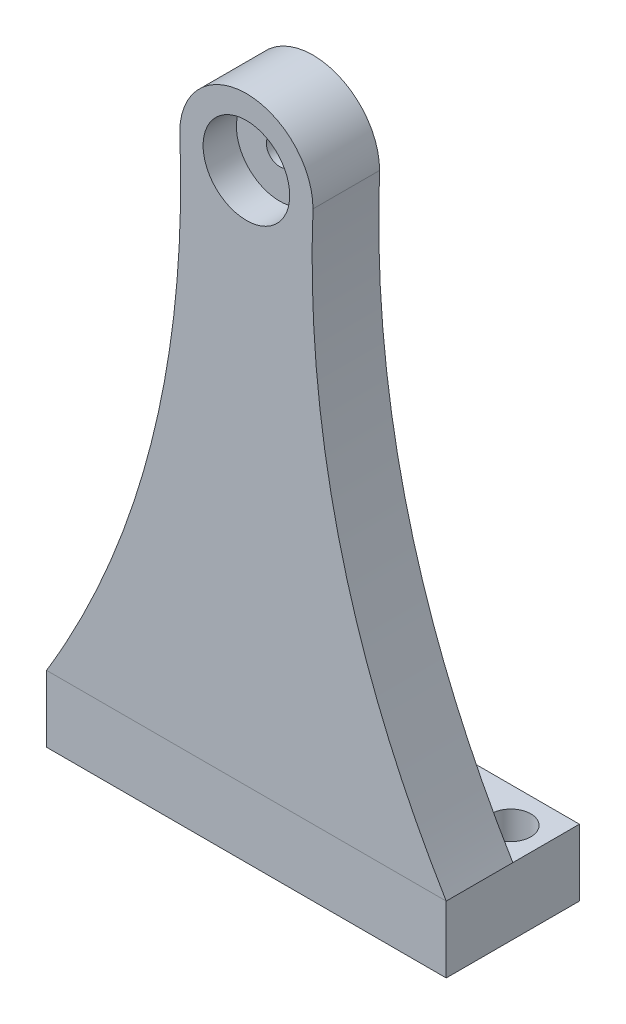
ISO-10303-21;
HEADER;
FILE_DESCRIPTION(('STEP AP214'),'2;1');
FILE_NAME('part.step','',(''),(''),'','','');
FILE_SCHEMA(('AUTOMOTIVE_DESIGN { 1 0 10303 214 1 1 1 1 }'));
ENDSEC;
DATA;
#1=APPLICATION_CONTEXT('core data for automotive mechanical design processes');
#2=APPLICATION_PROTOCOL_DEFINITION('international standard','automotive_design',2000,#1);
#3=PRODUCT_CONTEXT('',#1,'mechanical');
#4=PRODUCT('Part','Part','',(#3));
#5=PRODUCT_RELATED_PRODUCT_CATEGORY('part','',(#4));
#6=PRODUCT_DEFINITION_FORMATION('','',#4);
#7=PRODUCT_DEFINITION_CONTEXT('part definition',#1,'design');
#8=PRODUCT_DEFINITION('design','',#6,#7);
#9=PRODUCT_DEFINITION_SHAPE('','',#8);
#10=(LENGTH_UNIT() NAMED_UNIT(*) SI_UNIT(.MILLI.,.METRE.));
#11=(NAMED_UNIT(*) PLANE_ANGLE_UNIT() SI_UNIT($,.RADIAN.));
#12=(NAMED_UNIT(*) SI_UNIT($,.STERADIAN.) SOLID_ANGLE_UNIT());
#13=UNCERTAINTY_MEASURE_WITH_UNIT(LENGTH_MEASURE(1.E-05),#10,'distance_accuracy_value','');
#14=(GEOMETRIC_REPRESENTATION_CONTEXT(3) GLOBAL_UNCERTAINTY_ASSIGNED_CONTEXT((#13)) GLOBAL_UNIT_ASSIGNED_CONTEXT((#10,
#11,#12)) REPRESENTATION_CONTEXT('',''));
#15=CARTESIAN_POINT('',(0.,0.,0.));
#16=DIRECTION('',(0.,0.,1.));
#17=DIRECTION('',(1.,0.,0.));
#18=AXIS2_PLACEMENT_3D('',#15,#16,#17);
#19=CARTESIAN_POINT('',(9.99999999999998,80.,-10.));
#20=DIRECTION('',(0.,0.,1.));
#21=DIRECTION('',(1.,0.,0.));
#22=AXIS2_PLACEMENT_3D('',#19,#20,#21);
#23=CYLINDRICAL_SURFACE('',#22,2.);
#24=CARTESIAN_POINT('',(9.99999999999998,80.,-10.));
#25=DIRECTION('',(0.,0.,1.));
#26=DIRECTION('',(1.,0.,0.));
#27=AXIS2_PLACEMENT_3D('',#24,#25,#26);
#28=CIRCLE('',#27,2.);
#29=CARTESIAN_POINT('',(12.,80.,-10.));
#30=VERTEX_POINT('',#29);
#31=EDGE_CURVE('E163',#30,#30,#28,.T.);
#32=ORIENTED_EDGE('',*,*,#31,.F.);
#33=EDGE_LOOP('',(#32));
#34=FACE_BOUND('',#33,.T.);
#35=CARTESIAN_POINT('',(9.99999999999998,80.,-5.));
#36=DIRECTION('',(0.,0.,1.));
#37=DIRECTION('',(1.,0.,0.));
#38=AXIS2_PLACEMENT_3D('',#35,#36,#37);
#39=CIRCLE('',#38,2.);
#40=CARTESIAN_POINT('',(12.,80.,-5.));
#41=VERTEX_POINT('',#40);
#42=EDGE_CURVE('E53',#41,#41,#39,.F.);
#43=ORIENTED_EDGE('',*,*,#42,.F.);
#44=EDGE_LOOP('',(#43));
#45=FACE_BOUND('',#44,.T.);
#46=ADVANCED_FACE('F48',(#34,#45),#23,.F.);
#47=CARTESIAN_POINT('',(0.,80.,-10.));
#48=CARTESIAN_POINT('',(1.76343395350092,36.1747216860638,-10.));
#49=CARTESIAN_POINT('',(-20.,0.,-10.));
#50=B_SPLINE_CURVE_WITH_KNOTS('',2,(#47,#48,#49),.UNSPECIFIED.,.F.,.F.,(3,3),(0.,1.),.UNSPECIFIED.);
#51=DIRECTION('',(0.,0.,1.));
#52=VECTOR('',#51,1.);
#53=SURFACE_OF_LINEAR_EXTRUSION('',#50,#52);
#54=CARTESIAN_POINT('',(0.,80.,0.));
#55=CARTESIAN_POINT('',(1.76343395350092,36.1747216860638,0.));
#56=CARTESIAN_POINT('',(-20.,0.,0.));
#57=B_SPLINE_CURVE_WITH_KNOTS('',2,(#54,#55,#56),.UNSPECIFIED.,.F.,.F.,(3,3),(0.,1.),.UNSPECIFIED.);
#58=CARTESIAN_POINT('',(0.,80.,0.));
#59=VERTEX_POINT('',#58);
#60=CARTESIAN_POINT('',(-20.,0.,0.));
#61=VERTEX_POINT('',#60);
#62=EDGE_CURVE('E161',#59,#61,#57,.T.);
#63=ORIENTED_EDGE('',*,*,#62,.F.);
#64=DIRECTION('',(0.,0.,1.));
#65=VECTOR('',#64,1.);
#66=CARTESIAN_POINT('',(0.,80.,-10.));
#67=LINE('',#66,#65);
#68=CARTESIAN_POINT('',(0.,80.,-10.));
#69=VERTEX_POINT('',#68);
#70=EDGE_CURVE('E12',#69,#59,#67,.T.);
#71=ORIENTED_EDGE('',*,*,#70,.F.);
#72=CARTESIAN_POINT('',(-20.,0.,-10.));
#73=VERTEX_POINT('',#72);
#74=EDGE_CURVE('E110',#69,#73,#50,.T.);
#75=ORIENTED_EDGE('',*,*,#74,.T.);
#76=DIRECTION('',(0.,0.,1.));
#77=VECTOR('',#76,1.);
#78=CARTESIAN_POINT('',(-20.,0.,-10.));
#79=LINE('',#78,#77);
#80=EDGE_CURVE('E93',#73,#61,#79,.T.);
#81=ORIENTED_EDGE('',*,*,#80,.T.);
#82=EDGE_LOOP('',(#63,#71,#75,#81));
#83=FACE_BOUND('',#82,.T.);
#84=ADVANCED_FACE('F50',(#83),#53,.T.);
#85=CARTESIAN_POINT('',(9.99999999999998,80.,-10.));
#86=DIRECTION('',(0.,0.,1.));
#87=DIRECTION('',(1.,0.,0.));
#88=AXIS2_PLACEMENT_3D('',#85,#86,#87);
#89=CYLINDRICAL_SURFACE('',#88,10.);
#90=CARTESIAN_POINT('',(9.99999999999998,80.,0.));
#91=DIRECTION('',(0.,0.,1.));
#92=DIRECTION('',(-1.,0.,0.));
#93=AXIS2_PLACEMENT_3D('',#90,#91,#92);
#94=CIRCLE('',#93,10.);
#95=CARTESIAN_POINT('',(20.,80.,0.));
#96=VERTEX_POINT('',#95);
#97=EDGE_CURVE('E112',#96,#59,#94,.T.);
#98=ORIENTED_EDGE('',*,*,#97,.F.);
#99=DIRECTION('',(0.,0.,1.));
#100=VECTOR('',#99,1.);
#101=CARTESIAN_POINT('',(20.,80.,-10.));
#102=LINE('',#101,#100);
#103=CARTESIAN_POINT('',(20.,80.,-10.));
#104=VERTEX_POINT('',#103);
#105=EDGE_CURVE('E59',#104,#96,#102,.T.);
#106=ORIENTED_EDGE('',*,*,#105,.F.);
#107=CARTESIAN_POINT('',(9.99999999999998,80.,-10.));
#108=DIRECTION('',(0.,0.,1.));
#109=DIRECTION('',(-1.,0.,0.));
#110=AXIS2_PLACEMENT_3D('',#107,#108,#109);
#111=CIRCLE('',#110,10.);
#112=EDGE_CURVE('E107',#104,#69,#111,.T.);
#113=ORIENTED_EDGE('',*,*,#112,.T.);
#114=ORIENTED_EDGE('',*,*,#70,.T.);
#115=EDGE_LOOP('',(#98,#106,#113,#114));
#116=FACE_BOUND('',#115,.T.);
#117=ADVANCED_FACE('F128',(#116),#89,.T.);
#118=CARTESIAN_POINT('',(40.,0.,-10.));
#119=CARTESIAN_POINT('',(18.2365660464991,36.1747216860638,-10.));
#120=CARTESIAN_POINT('',(20.,80.,-10.));
#121=B_SPLINE_CURVE_WITH_KNOTS('',2,(#118,#119,#120),.UNSPECIFIED.,.F.,.F.,(3,3),(0.,1.),.UNSPECIFIED.);
#122=DIRECTION('',(0.,0.,1.));
#123=VECTOR('',#122,1.);
#124=SURFACE_OF_LINEAR_EXTRUSION('',#121,#123);
#125=CARTESIAN_POINT('',(40.,0.,0.));
#126=CARTESIAN_POINT('',(18.2365660464991,36.1747216860638,0.));
#127=CARTESIAN_POINT('',(20.,80.,0.));
#128=B_SPLINE_CURVE_WITH_KNOTS('',2,(#125,#126,#127),.UNSPECIFIED.,.F.,.F.,(3,3),(0.,1.),.UNSPECIFIED.);
#129=CARTESIAN_POINT('',(40.,0.,0.));
#130=VERTEX_POINT('',#129);
#131=EDGE_CURVE('E101',#130,#96,#128,.T.);
#132=ORIENTED_EDGE('',*,*,#131,.F.);
#133=DIRECTION('',(0.,0.,1.));
#134=VECTOR('',#133,1.);
#135=CARTESIAN_POINT('',(40.,0.,-10.));
#136=LINE('',#135,#134);
#137=CARTESIAN_POINT('',(40.,0.,-10.));
#138=VERTEX_POINT('',#137);
#139=EDGE_CURVE('E96',#138,#130,#136,.T.);
#140=ORIENTED_EDGE('',*,*,#139,.F.);
#141=EDGE_CURVE('E99',#138,#104,#121,.T.);
#142=ORIENTED_EDGE('',*,*,#141,.T.);
#143=ORIENTED_EDGE('',*,*,#105,.T.);
#144=EDGE_LOOP('',(#132,#140,#142,#143));
#145=FACE_BOUND('',#144,.T.);
#146=ADVANCED_FACE('F98',(#145),#124,.T.);
#147=CARTESIAN_POINT('',(-20.,0.,-10.));
#148=DIRECTION('',(0.,-1.,0.));
#149=DIRECTION('',(0.,0.,-1.));
#150=AXIS2_PLACEMENT_3D('',#147,#148,#149);
#151=PLANE('',#150);
#152=DIRECTION('',(1.,0.,0.));
#153=VECTOR('',#152,1.);
#154=CARTESIAN_POINT('',(-20.,0.,0.));
#155=LINE('',#154,#153);
#156=EDGE_CURVE('E162',#61,#130,#155,.T.);
#157=ORIENTED_EDGE('',*,*,#156,.F.);
#158=ORIENTED_EDGE('',*,*,#80,.F.);
#159=DIRECTION('',(1.,0.,0.));
#160=VECTOR('',#159,1.);
#161=CARTESIAN_POINT('',(-20.,0.,-10.));
#162=LINE('',#161,#160);
#163=EDGE_CURVE('E106',#73,#138,#162,.T.);
#164=ORIENTED_EDGE('',*,*,#163,.T.);
#165=ORIENTED_EDGE('',*,*,#139,.T.);
#166=EDGE_LOOP('',(#157,#158,#164,#165));
#167=FACE_BOUND('',#166,.T.);
#168=ADVANCED_FACE('F109',(#167),#151,.T.);
#169=CARTESIAN_POINT('',(-4.11828302324955,38.0873608430319,-10.));
#170=DIRECTION('',(0.,0.,-1.));
#171=DIRECTION('',(-1.,0.,0.));
#172=AXIS2_PLACEMENT_3D('',#169,#170,#171);
#173=PLANE('',#172);
#174=ORIENTED_EDGE('',*,*,#31,.T.);
#175=EDGE_LOOP('',(#174));
#176=FACE_BOUND('',#175,.T.);
#177=ORIENTED_EDGE('',*,*,#74,.F.);
#178=ORIENTED_EDGE('',*,*,#112,.F.);
#179=ORIENTED_EDGE('',*,*,#141,.F.);
#180=ORIENTED_EDGE('',*,*,#163,.F.);
#181=EDGE_LOOP('',(#177,#178,#179,#180));
#182=FACE_BOUND('',#181,.T.);
#183=ADVANCED_FACE('F105',(#176,#182),#173,.T.);
#184=CARTESIAN_POINT('',(-4.11828302324955,38.0873608430319,0.));
#185=DIRECTION('',(0.,0.,-1.));
#186=DIRECTION('',(-1.,0.,0.));
#187=AXIS2_PLACEMENT_3D('',#184,#185,#186);
#188=PLANE('',#187);
#189=CARTESIAN_POINT('',(9.99999999999998,80.,0.));
#190=DIRECTION('',(0.,0.,1.));
#191=DIRECTION('',(1.,0.,0.));
#192=AXIS2_PLACEMENT_3D('',#189,#190,#191);
#193=CIRCLE('',#192,6.5);
#194=CARTESIAN_POINT('',(16.5,80.,0.));
#195=VERTEX_POINT('',#194);
#196=EDGE_CURVE('E158',#195,#195,#193,.T.);
#197=ORIENTED_EDGE('',*,*,#196,.F.);
#198=EDGE_LOOP('',(#197));
#199=FACE_BOUND('',#198,.T.);
#200=ORIENTED_EDGE('',*,*,#62,.T.);
#201=ORIENTED_EDGE('',*,*,#156,.T.);
#202=ORIENTED_EDGE('',*,*,#131,.T.);
#203=ORIENTED_EDGE('',*,*,#97,.T.);
#204=EDGE_LOOP('',(#200,#201,#202,#203));
#205=FACE_BOUND('',#204,.T.);
#206=ADVANCED_FACE('F134',(#199,#205),#188,.F.);
#207=CARTESIAN_POINT('',(9.99999999999998,80.,-5.));
#208=DIRECTION('',(0.,0.,1.));
#209=DIRECTION('',(1.,0.,0.));
#210=AXIS2_PLACEMENT_3D('',#207,#208,#209);
#211=PLANE('',#210);
#212=CARTESIAN_POINT('',(9.99999999999998,80.,-5.));
#213=DIRECTION('',(0.,0.,1.));
#214=DIRECTION('',(1.,0.,0.));
#215=AXIS2_PLACEMENT_3D('',#212,#213,#214);
#216=CIRCLE('',#215,6.5);
#217=CARTESIAN_POINT('',(16.5,80.,-5.));
#218=VERTEX_POINT('',#217);
#219=EDGE_CURVE('E229',#218,#218,#216,.T.);
#220=ORIENTED_EDGE('',*,*,#219,.T.);
#221=EDGE_LOOP('',(#220));
#222=FACE_BOUND('',#221,.T.);
#223=ORIENTED_EDGE('',*,*,#42,.T.);
#224=EDGE_LOOP('',(#223));
#225=FACE_BOUND('',#224,.T.);
#226=ADVANCED_FACE('F149',(#222,#225),#211,.T.);
#227=CARTESIAN_POINT('',(9.99999999999998,80.,-5.));
#228=DIRECTION('',(0.,0.,1.));
#229=DIRECTION('',(1.,0.,0.));
#230=AXIS2_PLACEMENT_3D('',#227,#228,#229);
#231=CYLINDRICAL_SURFACE('',#230,6.5);
#232=ORIENTED_EDGE('',*,*,#219,.F.);
#233=EDGE_LOOP('',(#232));
#234=FACE_BOUND('',#233,.T.);
#235=ORIENTED_EDGE('',*,*,#196,.T.);
#236=EDGE_LOOP('',(#235));
#237=FACE_BOUND('',#236,.T.);
#238=ADVANCED_FACE('F146',(#234,#237),#231,.F.);
#239=CLOSED_SHELL('',(#46,#84,#117,#146,#168,#183,#206,#226,#238));
#240=MANIFOLD_SOLID_BREP('B2',#239);
#241=CARTESIAN_POINT('',(-20.,-10.,0.));
#242=DIRECTION('',(0.,0.,1.));
#243=DIRECTION('',(1.,0.,0.));
#244=AXIS2_PLACEMENT_3D('',#241,#242,#243);
#245=PLANE('',#244);
#246=DIRECTION('',(1.,0.,0.));
#247=VECTOR('',#246,1.);
#248=CARTESIAN_POINT('',(-20.,0.,0.));
#249=LINE('',#248,#247);
#250=CARTESIAN_POINT('',(-20.,0.,0.));
#251=VERTEX_POINT('',#250);
#252=CARTESIAN_POINT('',(40.,0.,0.));
#253=VERTEX_POINT('',#252);
#254=EDGE_CURVE('E323',#251,#253,#249,.T.);
#255=ORIENTED_EDGE('',*,*,#254,.F.);
#256=DIRECTION('',(0.,1.,0.));
#257=VECTOR('',#256,1.);
#258=CARTESIAN_POINT('',(-20.,-10.,0.));
#259=LINE('',#258,#257);
#260=CARTESIAN_POINT('',(-20.,-10.,0.));
#261=VERTEX_POINT('',#260);
#262=EDGE_CURVE('E46',#261,#251,#259,.T.);
#263=ORIENTED_EDGE('',*,*,#262,.F.);
#264=DIRECTION('',(1.,0.,0.));
#265=VECTOR('',#264,1.);
#266=CARTESIAN_POINT('',(-20.,-10.,0.));
#267=LINE('',#266,#265);
#268=CARTESIAN_POINT('',(40.,-10.,0.));
#269=VERTEX_POINT('',#268);
#270=EDGE_CURVE('E316',#261,#269,#267,.T.);
#271=ORIENTED_EDGE('',*,*,#270,.T.);
#272=DIRECTION('',(0.,1.,0.));
#273=VECTOR('',#272,1.);
#274=CARTESIAN_POINT('',(40.,-10.,0.));
#275=LINE('',#274,#273);
#276=EDGE_CURVE('E261',#269,#253,#275,.T.);
#277=ORIENTED_EDGE('',*,*,#276,.T.);
#278=EDGE_LOOP('',(#255,#263,#271,#277));
#279=FACE_BOUND('',#278,.T.);
#280=ADVANCED_FACE('F258',(#279),#245,.T.);
#281=CARTESIAN_POINT('',(-20.,-10.,0.));
#282=DIRECTION('',(-1.,0.,0.));
#283=DIRECTION('',(0.,0.,1.));
#284=AXIS2_PLACEMENT_3D('',#281,#282,#283);
#285=PLANE('',#284);
#286=DIRECTION('',(0.,0.,1.));
#287=VECTOR('',#286,1.);
#288=CARTESIAN_POINT('',(-20.,0.,0.));
#289=LINE('',#288,#287);
#290=CARTESIAN_POINT('',(-20.,0.,-20.));
#291=VERTEX_POINT('',#290);
#292=EDGE_CURVE('E318',#291,#251,#289,.T.);
#293=ORIENTED_EDGE('',*,*,#292,.F.);
#294=DIRECTION('',(0.,1.,0.));
#295=VECTOR('',#294,1.);
#296=CARTESIAN_POINT('',(-20.,-10.,-20.));
#297=LINE('',#296,#295);
#298=CARTESIAN_POINT('',(-20.,-10.,-20.));
#299=VERTEX_POINT('',#298);
#300=EDGE_CURVE('E267',#299,#291,#297,.T.);
#301=ORIENTED_EDGE('',*,*,#300,.F.);
#302=DIRECTION('',(0.,0.,1.));
#303=VECTOR('',#302,1.);
#304=CARTESIAN_POINT('',(-20.,-10.,0.));
#305=LINE('',#304,#303);
#306=EDGE_CURVE('E313',#299,#261,#305,.T.);
#307=ORIENTED_EDGE('',*,*,#306,.T.);
#308=ORIENTED_EDGE('',*,*,#262,.T.);
#309=EDGE_LOOP('',(#293,#301,#307,#308));
#310=FACE_BOUND('',#309,.T.);
#311=ADVANCED_FACE('F334',(#310),#285,.T.);
#312=CARTESIAN_POINT('',(-20.,-10.,-20.));
#313=DIRECTION('',(0.,0.,-1.));
#314=DIRECTION('',(-1.,0.,0.));
#315=AXIS2_PLACEMENT_3D('',#312,#313,#314);
#316=PLANE('',#315);
#317=DIRECTION('',(-1.,0.,0.));
#318=VECTOR('',#317,1.);
#319=CARTESIAN_POINT('',(-20.,0.,-20.));
#320=LINE('',#319,#318);
#321=CARTESIAN_POINT('',(40.,0.,-20.));
#322=VERTEX_POINT('',#321);
#323=EDGE_CURVE('E308',#322,#291,#320,.T.);
#324=ORIENTED_EDGE('',*,*,#323,.F.);
#325=DIRECTION('',(0.,1.,0.));
#326=VECTOR('',#325,1.);
#327=CARTESIAN_POINT('',(40.,-10.,-20.));
#328=LINE('',#327,#326);
#329=CARTESIAN_POINT('',(40.,-10.,-20.));
#330=VERTEX_POINT('',#329);
#331=EDGE_CURVE('E303',#330,#322,#328,.T.);
#332=ORIENTED_EDGE('',*,*,#331,.F.);
#333=DIRECTION('',(-1.,0.,0.));
#334=VECTOR('',#333,1.);
#335=CARTESIAN_POINT('',(-20.,-10.,-20.));
#336=LINE('',#335,#334);
#337=EDGE_CURVE('E306',#330,#299,#336,.T.);
#338=ORIENTED_EDGE('',*,*,#337,.T.);
#339=ORIENTED_EDGE('',*,*,#300,.T.);
#340=EDGE_LOOP('',(#324,#332,#338,#339));
#341=FACE_BOUND('',#340,.T.);
#342=ADVANCED_FACE('F305',(#341),#316,.T.);
#343=CARTESIAN_POINT('',(40.,-10.,-20.));
#344=DIRECTION('',(1.,0.,0.));
#345=DIRECTION('',(0.,0.,-1.));
#346=AXIS2_PLACEMENT_3D('',#343,#344,#345);
#347=PLANE('',#346);
#348=DIRECTION('',(0.,0.,-1.));
#349=VECTOR('',#348,1.);
#350=CARTESIAN_POINT('',(40.,0.,-20.));
#351=LINE('',#350,#349);
#352=EDGE_CURVE('E326',#253,#322,#351,.T.);
#353=ORIENTED_EDGE('',*,*,#352,.F.);
#354=ORIENTED_EDGE('',*,*,#276,.F.);
#355=DIRECTION('',(0.,0.,-1.));
#356=VECTOR('',#355,1.);
#357=CARTESIAN_POINT('',(40.,-10.,-20.));
#358=LINE('',#357,#356);
#359=EDGE_CURVE('E312',#269,#330,#358,.T.);
#360=ORIENTED_EDGE('',*,*,#359,.T.);
#361=ORIENTED_EDGE('',*,*,#331,.T.);
#362=EDGE_LOOP('',(#353,#354,#360,#361));
#363=FACE_BOUND('',#362,.T.);
#364=ADVANCED_FACE('F315',(#363),#347,.T.);
#365=CARTESIAN_POINT('',(0.,-10.,0.));
#366=DIRECTION('',(0.,-1.,0.));
#367=DIRECTION('',(0.,0.,-1.));
#368=AXIS2_PLACEMENT_3D('',#365,#366,#367);
#369=PLANE('',#368);
#370=CARTESIAN_POINT('',(35.,-10.,-14.7));
#371=DIRECTION('',(0.,1.,0.));
#372=DIRECTION('',(0.,0.,1.));
#373=AXIS2_PLACEMENT_3D('',#370,#371,#372);
#374=CIRCLE('',#373,3.);
#375=CARTESIAN_POINT('',(35.,-10.,-11.7));
#376=VERTEX_POINT('',#375);
#377=EDGE_CURVE('E367',#376,#376,#374,.T.);
#378=ORIENTED_EDGE('',*,*,#377,.T.);
#379=EDGE_LOOP('',(#378));
#380=FACE_BOUND('',#379,.T.);
#381=CARTESIAN_POINT('',(-15.,-10.,-14.7));
#382=DIRECTION('',(0.,1.,0.));
#383=DIRECTION('',(0.,0.,1.));
#384=AXIS2_PLACEMENT_3D('',#381,#382,#383);
#385=CIRCLE('',#384,3.);
#386=CARTESIAN_POINT('',(-15.,-10.,-11.7));
#387=VERTEX_POINT('',#386);
#388=EDGE_CURVE('E327',#387,#387,#385,.T.);
#389=ORIENTED_EDGE('',*,*,#388,.T.);
#390=EDGE_LOOP('',(#389));
#391=FACE_BOUND('',#390,.T.);
#392=ORIENTED_EDGE('',*,*,#270,.F.);
#393=ORIENTED_EDGE('',*,*,#306,.F.);
#394=ORIENTED_EDGE('',*,*,#337,.F.);
#395=ORIENTED_EDGE('',*,*,#359,.F.);
#396=EDGE_LOOP('',(#392,#393,#394,#395));
#397=FACE_BOUND('',#396,.T.);
#398=ADVANCED_FACE('F311',(#380,#391,#397),#369,.T.);
#399=CARTESIAN_POINT('',(0.,0.,0.));
#400=DIRECTION('',(0.,-1.,0.));
#401=DIRECTION('',(0.,0.,-1.));
#402=AXIS2_PLACEMENT_3D('',#399,#400,#401);
#403=PLANE('',#402);
#404=CARTESIAN_POINT('',(35.,0.,-14.7));
#405=DIRECTION('',(0.,1.,0.));
#406=DIRECTION('',(0.,0.,1.));
#407=AXIS2_PLACEMENT_3D('',#404,#405,#406);
#408=CIRCLE('',#407,3.);
#409=CARTESIAN_POINT('',(35.,0.,-11.7));
#410=VERTEX_POINT('',#409);
#411=EDGE_CURVE('E370',#410,#410,#408,.T.);
#412=ORIENTED_EDGE('',*,*,#411,.F.);
#413=EDGE_LOOP('',(#412));
#414=FACE_BOUND('',#413,.T.);
#415=CARTESIAN_POINT('',(-15.,0.,-14.7));
#416=DIRECTION('',(0.,1.,0.));
#417=DIRECTION('',(0.,0.,1.));
#418=AXIS2_PLACEMENT_3D('',#415,#416,#417);
#419=CIRCLE('',#418,3.);
#420=CARTESIAN_POINT('',(-15.,0.,-11.7));
#421=VERTEX_POINT('',#420);
#422=EDGE_CURVE('E372',#421,#421,#419,.T.);
#423=ORIENTED_EDGE('',*,*,#422,.F.);
#424=EDGE_LOOP('',(#423));
#425=FACE_BOUND('',#424,.T.);
#426=ORIENTED_EDGE('',*,*,#254,.T.);
#427=ORIENTED_EDGE('',*,*,#352,.T.);
#428=ORIENTED_EDGE('',*,*,#323,.T.);
#429=ORIENTED_EDGE('',*,*,#292,.T.);
#430=EDGE_LOOP('',(#426,#427,#428,#429));
#431=FACE_BOUND('',#430,.T.);
#432=ADVANCED_FACE('F333',(#414,#425,#431),#403,.F.);
#433=CARTESIAN_POINT('',(-15.,-10.,-14.7));
#434=DIRECTION('',(0.,1.,0.));
#435=DIRECTION('',(0.,0.,1.));
#436=AXIS2_PLACEMENT_3D('',#433,#434,#435);
#437=CYLINDRICAL_SURFACE('',#436,3.);
#438=ORIENTED_EDGE('',*,*,#388,.F.);
#439=EDGE_LOOP('',(#438));
#440=FACE_BOUND('',#439,.T.);
#441=ORIENTED_EDGE('',*,*,#422,.T.);
#442=EDGE_LOOP('',(#441));
#443=FACE_BOUND('',#442,.T.);
#444=ADVANCED_FACE('F352',(#440,#443),#437,.F.);
#445=CARTESIAN_POINT('',(35.,-10.,-14.7));
#446=DIRECTION('',(0.,1.,0.));
#447=DIRECTION('',(0.,0.,1.));
#448=AXIS2_PLACEMENT_3D('',#445,#446,#447);
#449=CYLINDRICAL_SURFACE('',#448,3.);
#450=ORIENTED_EDGE('',*,*,#377,.F.);
#451=EDGE_LOOP('',(#450));
#452=FACE_BOUND('',#451,.T.);
#453=ORIENTED_EDGE('',*,*,#411,.T.);
#454=EDGE_LOOP('',(#453));
#455=FACE_BOUND('',#454,.T.);
#456=ADVANCED_FACE('F359',(#452,#455),#449,.F.);
#457=CLOSED_SHELL('',(#280,#311,#342,#364,#398,#432,#444,#456));
#458=MANIFOLD_SOLID_BREP('B6',#457);
#459=ADVANCED_BREP_SHAPE_REPRESENTATION('',(#18,#240,#458),#14);
#460=SHAPE_DEFINITION_REPRESENTATION(#9,#459);
ENDSEC;
END-ISO-10303-21;
